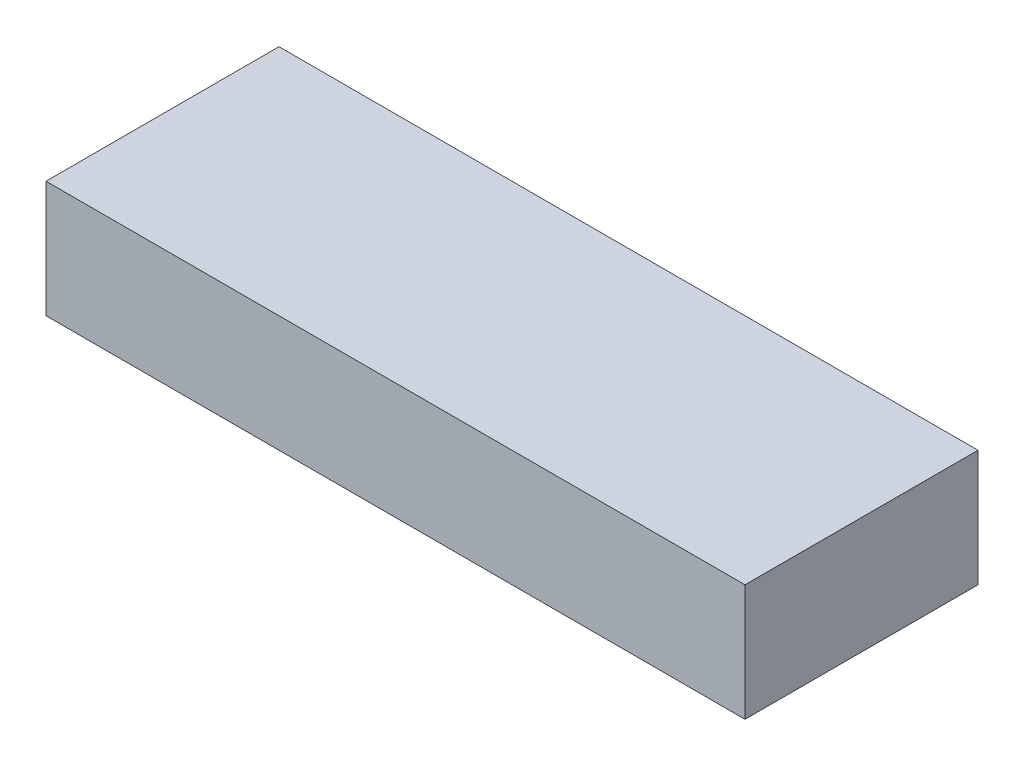
ISO-10303-21;
HEADER;
FILE_DESCRIPTION(('STEP AP214'),'2;1');
FILE_NAME('part.step','',(''),(''),'','','');
FILE_SCHEMA(('AUTOMOTIVE_DESIGN { 1 0 10303 214 1 1 1 1 }'));
ENDSEC;
DATA;
#1=APPLICATION_CONTEXT('core data for automotive mechanical design processes');
#2=APPLICATION_PROTOCOL_DEFINITION('international standard','automotive_design',2000,#1);
#3=PRODUCT_CONTEXT('',#1,'mechanical');
#4=PRODUCT('Part','Part','',(#3));
#5=PRODUCT_RELATED_PRODUCT_CATEGORY('part','',(#4));
#6=PRODUCT_DEFINITION_FORMATION('','',#4);
#7=PRODUCT_DEFINITION_CONTEXT('part definition',#1,'design');
#8=PRODUCT_DEFINITION('design','',#6,#7);
#9=PRODUCT_DEFINITION_SHAPE('','',#8);
#10=(LENGTH_UNIT() NAMED_UNIT(*) SI_UNIT(.MILLI.,.METRE.));
#11=(NAMED_UNIT(*) PLANE_ANGLE_UNIT() SI_UNIT($,.RADIAN.));
#12=(NAMED_UNIT(*) SI_UNIT($,.STERADIAN.) SOLID_ANGLE_UNIT());
#13=UNCERTAINTY_MEASURE_WITH_UNIT(LENGTH_MEASURE(1.E-05),#10,'distance_accuracy_value','');
#14=(GEOMETRIC_REPRESENTATION_CONTEXT(3) GLOBAL_UNCERTAINTY_ASSIGNED_CONTEXT((#13)) GLOBAL_UNIT_ASSIGNED_CONTEXT((#10,
#11,#12)) REPRESENTATION_CONTEXT('',''));
#15=CARTESIAN_POINT('',(0.,0.,0.));
#16=DIRECTION('',(0.,0.,1.));
#17=DIRECTION('',(1.,0.,0.));
#18=AXIS2_PLACEMENT_3D('',#15,#16,#17);
#19=CARTESIAN_POINT('',(-30.,10.,-10.));
#20=DIRECTION('',(1.,0.,0.));
#21=DIRECTION('',(0.,0.,-1.));
#22=AXIS2_PLACEMENT_3D('',#19,#20,#21);
#23=PLANE('',#22);
#24=DIRECTION('',(0.,0.,1.));
#25=VECTOR('',#24,1.);
#26=CARTESIAN_POINT('',(-30.,0.,-10.));
#27=LINE('',#26,#25);
#28=CARTESIAN_POINT('',(-30.,0.,-10.));
#29=VERTEX_POINT('',#28);
#30=CARTESIAN_POINT('',(-30.,0.,10.));
#31=VERTEX_POINT('',#30);
#32=EDGE_CURVE('E107',#29,#31,#27,.T.);
#33=ORIENTED_EDGE('',*,*,#32,.T.);
#34=DIRECTION('',(0.,-1.,0.));
#35=VECTOR('',#34,1.);
#36=CARTESIAN_POINT('',(-30.,10.,10.));
#37=LINE('',#36,#35);
#38=CARTESIAN_POINT('',(-30.,10.,10.));
#39=VERTEX_POINT('',#38);
#40=EDGE_CURVE('E11',#39,#31,#37,.T.);
#41=ORIENTED_EDGE('',*,*,#40,.F.);
#42=DIRECTION('',(0.,0.,1.));
#43=VECTOR('',#42,1.);
#44=CARTESIAN_POINT('',(-30.,10.,-10.));
#45=LINE('',#44,#43);
#46=CARTESIAN_POINT('',(-30.,10.,-10.));
#47=VERTEX_POINT('',#46);
#48=EDGE_CURVE('E91',#47,#39,#45,.T.);
#49=ORIENTED_EDGE('',*,*,#48,.F.);
#50=DIRECTION('',(0.,-1.,0.));
#51=VECTOR('',#50,1.);
#52=CARTESIAN_POINT('',(-30.,10.,-10.));
#53=LINE('',#52,#51);
#54=EDGE_CURVE('E103',#47,#29,#53,.T.);
#55=ORIENTED_EDGE('',*,*,#54,.T.);
#56=EDGE_LOOP('',(#33,#41,#49,#55));
#57=FACE_BOUND('',#56,.T.);
#58=ADVANCED_FACE('F39',(#57),#23,.F.);
#59=CARTESIAN_POINT('',(30.,10.,10.));
#60=DIRECTION('',(0.,0.,-1.));
#61=DIRECTION('',(-1.,0.,0.));
#62=AXIS2_PLACEMENT_3D('',#59,#60,#61);
#63=PLANE('',#62);
#64=DIRECTION('',(1.,0.,0.));
#65=VECTOR('',#64,1.);
#66=CARTESIAN_POINT('',(30.,0.,10.));
#67=LINE('',#66,#65);
#68=CARTESIAN_POINT('',(30.,0.,10.));
#69=VERTEX_POINT('',#68);
#70=EDGE_CURVE('E96',#31,#69,#67,.T.);
#71=ORIENTED_EDGE('',*,*,#70,.T.);
#72=DIRECTION('',(0.,-1.,0.));
#73=VECTOR('',#72,1.);
#74=CARTESIAN_POINT('',(30.,10.,10.));
#75=LINE('',#74,#73);
#76=CARTESIAN_POINT('',(30.,10.,10.));
#77=VERTEX_POINT('',#76);
#78=EDGE_CURVE('E48',#77,#69,#75,.T.);
#79=ORIENTED_EDGE('',*,*,#78,.F.);
#80=DIRECTION('',(1.,0.,0.));
#81=VECTOR('',#80,1.);
#82=CARTESIAN_POINT('',(30.,10.,10.));
#83=LINE('',#82,#81);
#84=EDGE_CURVE('E86',#39,#77,#83,.T.);
#85=ORIENTED_EDGE('',*,*,#84,.F.);
#86=ORIENTED_EDGE('',*,*,#40,.T.);
#87=EDGE_LOOP('',(#71,#79,#85,#86));
#88=FACE_BOUND('',#87,.T.);
#89=ADVANCED_FACE('F95',(#88),#63,.F.);
#90=CARTESIAN_POINT('',(30.,10.,-10.));
#91=DIRECTION('',(-1.,0.,0.));
#92=DIRECTION('',(0.,0.,1.));
#93=AXIS2_PLACEMENT_3D('',#90,#91,#92);
#94=PLANE('',#93);
#95=DIRECTION('',(0.,0.,-1.));
#96=VECTOR('',#95,1.);
#97=CARTESIAN_POINT('',(30.,0.,-10.));
#98=LINE('',#97,#96);
#99=CARTESIAN_POINT('',(30.,0.,-10.));
#100=VERTEX_POINT('',#99);
#101=EDGE_CURVE('E73',#69,#100,#98,.T.);
#102=ORIENTED_EDGE('',*,*,#101,.T.);
#103=DIRECTION('',(0.,-1.,0.));
#104=VECTOR('',#103,1.);
#105=CARTESIAN_POINT('',(30.,10.,-10.));
#106=LINE('',#105,#104);
#107=CARTESIAN_POINT('',(30.,10.,-10.));
#108=VERTEX_POINT('',#107);
#109=EDGE_CURVE('E98',#108,#100,#106,.T.);
#110=ORIENTED_EDGE('',*,*,#109,.F.);
#111=DIRECTION('',(0.,0.,-1.));
#112=VECTOR('',#111,1.);
#113=CARTESIAN_POINT('',(30.,10.,-10.));
#114=LINE('',#113,#112);
#115=EDGE_CURVE('E89',#77,#108,#114,.T.);
#116=ORIENTED_EDGE('',*,*,#115,.F.);
#117=ORIENTED_EDGE('',*,*,#78,.T.);
#118=EDGE_LOOP('',(#102,#110,#116,#117));
#119=FACE_BOUND('',#118,.T.);
#120=ADVANCED_FACE('F99',(#119),#94,.F.);
#121=CARTESIAN_POINT('',(30.,10.,-10.));
#122=DIRECTION('',(0.,0.,1.));
#123=DIRECTION('',(1.,0.,0.));
#124=AXIS2_PLACEMENT_3D('',#121,#122,#123);
#125=PLANE('',#124);
#126=DIRECTION('',(-1.,0.,0.));
#127=VECTOR('',#126,1.);
#128=CARTESIAN_POINT('',(30.,0.,-10.));
#129=LINE('',#128,#127);
#130=EDGE_CURVE('E79',#100,#29,#129,.T.);
#131=ORIENTED_EDGE('',*,*,#130,.T.);
#132=ORIENTED_EDGE('',*,*,#54,.F.);
#133=DIRECTION('',(-1.,0.,0.));
#134=VECTOR('',#133,1.);
#135=CARTESIAN_POINT('',(30.,10.,-10.));
#136=LINE('',#135,#134);
#137=EDGE_CURVE('E56',#108,#47,#136,.T.);
#138=ORIENTED_EDGE('',*,*,#137,.F.);
#139=ORIENTED_EDGE('',*,*,#109,.T.);
#140=EDGE_LOOP('',(#131,#132,#138,#139));
#141=FACE_BOUND('',#140,.T.);
#142=ADVANCED_FACE('F120',(#141),#125,.F.);
#143=CARTESIAN_POINT('',(0.,10.,0.));
#144=DIRECTION('',(0.,-1.,0.));
#145=DIRECTION('',(0.,0.,-1.));
#146=AXIS2_PLACEMENT_3D('',#143,#144,#145);
#147=PLANE('',#146);
#148=ORIENTED_EDGE('',*,*,#48,.T.);
#149=ORIENTED_EDGE('',*,*,#84,.T.);
#150=ORIENTED_EDGE('',*,*,#115,.T.);
#151=ORIENTED_EDGE('',*,*,#137,.T.);
#152=EDGE_LOOP('',(#148,#149,#150,#151));
#153=FACE_BOUND('',#152,.T.);
#154=ADVANCED_FACE('F87',(#153),#147,.F.);
#155=CARTESIAN_POINT('',(0.,0.,0.));
#156=DIRECTION('',(0.,-1.,0.));
#157=DIRECTION('',(0.,0.,-1.));
#158=AXIS2_PLACEMENT_3D('',#155,#156,#157);
#159=PLANE('',#158);
#160=ORIENTED_EDGE('',*,*,#32,.F.);
#161=ORIENTED_EDGE('',*,*,#130,.F.);
#162=ORIENTED_EDGE('',*,*,#101,.F.);
#163=ORIENTED_EDGE('',*,*,#70,.F.);
#164=EDGE_LOOP('',(#160,#161,#162,#163));
#165=FACE_BOUND('',#164,.T.);
#166=ADVANCED_FACE('F123',(#165),#159,.T.);
#167=CLOSED_SHELL('',(#58,#89,#120,#142,#154,#166));
#168=MANIFOLD_SOLID_BREP('B2',#167);
#169=ADVANCED_BREP_SHAPE_REPRESENTATION('',(#18,#168),#14);
#170=SHAPE_DEFINITION_REPRESENTATION(#9,#169);
ENDSEC;
END-ISO-10303-21;
